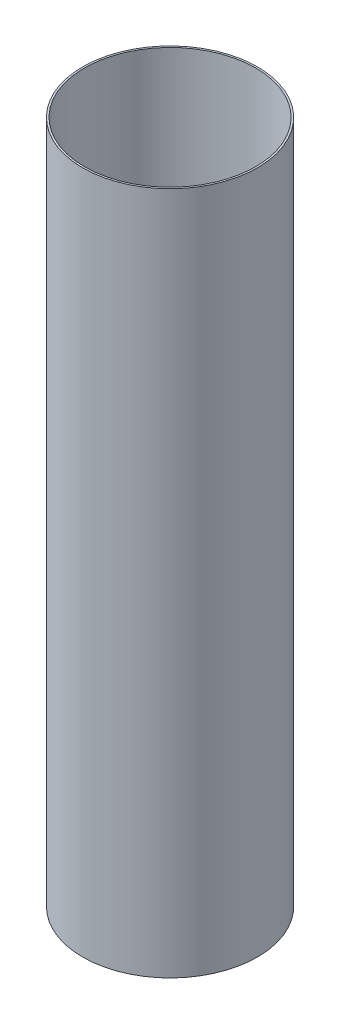
ISO-10303-21;
HEADER;
FILE_DESCRIPTION(('STEP AP214'),'2;1');
FILE_NAME('part.step','',(''),(''),'','','');
FILE_SCHEMA(('AUTOMOTIVE_DESIGN { 1 0 10303 214 1 1 1 1 }'));
ENDSEC;
DATA;
#1=APPLICATION_CONTEXT('core data for automotive mechanical design processes');
#2=APPLICATION_PROTOCOL_DEFINITION('international standard','automotive_design',2000,#1);
#3=PRODUCT_CONTEXT('',#1,'mechanical');
#4=PRODUCT('Part','Part','',(#3));
#5=PRODUCT_RELATED_PRODUCT_CATEGORY('part','',(#4));
#6=PRODUCT_DEFINITION_FORMATION('','',#4);
#7=PRODUCT_DEFINITION_CONTEXT('part definition',#1,'design');
#8=PRODUCT_DEFINITION('design','',#6,#7);
#9=PRODUCT_DEFINITION_SHAPE('','',#8);
#10=(LENGTH_UNIT() NAMED_UNIT(*) SI_UNIT(.MILLI.,.METRE.));
#11=(NAMED_UNIT(*) PLANE_ANGLE_UNIT() SI_UNIT($,.RADIAN.));
#12=(NAMED_UNIT(*) SI_UNIT($,.STERADIAN.) SOLID_ANGLE_UNIT());
#13=UNCERTAINTY_MEASURE_WITH_UNIT(LENGTH_MEASURE(1.E-05),#10,'distance_accuracy_value','');
#14=(GEOMETRIC_REPRESENTATION_CONTEXT(3) GLOBAL_UNCERTAINTY_ASSIGNED_CONTEXT((#13)) GLOBAL_UNIT_ASSIGNED_CONTEXT((#10,
#11,#12)) REPRESENTATION_CONTEXT('',''));
#15=CARTESIAN_POINT('',(0.,0.,0.));
#16=DIRECTION('',(0.,0.,1.));
#17=DIRECTION('',(1.,0.,0.));
#18=AXIS2_PLACEMENT_3D('',#15,#16,#17);
#19=CARTESIAN_POINT('',(0.,762.,0.));
#20=DIRECTION('',(0.,1.,0.));
#21=DIRECTION('',(0.,0.,1.));
#22=AXIS2_PLACEMENT_3D('',#19,#20,#21);
#23=PLANE('',#22);
#24=CARTESIAN_POINT('',(0.,762.,0.));
#25=DIRECTION('',(0.,1.,0.));
#26=DIRECTION('',(0.,0.,1.));
#27=AXIS2_PLACEMENT_3D('',#24,#25,#26);
#28=CIRCLE('',#27,97.4725);
#29=CARTESIAN_POINT('',(0.,762.,97.4725));
#30=VERTEX_POINT('',#29);
#31=EDGE_CURVE('E10',#30,#30,#28,.T.);
#32=ORIENTED_EDGE('',*,*,#31,.T.);
#33=EDGE_LOOP('',(#32));
#34=FACE_BOUND('',#33,.T.);
#35=CARTESIAN_POINT('',(0.,762.,0.));
#36=DIRECTION('',(0.,1.,0.));
#37=DIRECTION('',(0.,0.,1.));
#38=AXIS2_PLACEMENT_3D('',#35,#36,#37);
#39=CIRCLE('',#38,95.4405);
#40=CARTESIAN_POINT('',(0.,762.,95.4405));
#41=VERTEX_POINT('',#40);
#42=EDGE_CURVE('E41',#41,#41,#39,.T.);
#43=ORIENTED_EDGE('',*,*,#42,.F.);
#44=EDGE_LOOP('',(#43));
#45=FACE_BOUND('',#44,.T.);
#46=ADVANCED_FACE('F30',(#34,#45),#23,.T.);
#47=CARTESIAN_POINT('',(0.,0.,0.));
#48=DIRECTION('',(0.,1.,0.));
#49=DIRECTION('',(0.,0.,1.));
#50=AXIS2_PLACEMENT_3D('',#47,#48,#49);
#51=PLANE('',#50);
#52=CARTESIAN_POINT('',(0.,0.,0.));
#53=DIRECTION('',(0.,1.,0.));
#54=DIRECTION('',(0.,0.,1.));
#55=AXIS2_PLACEMENT_3D('',#52,#53,#54);
#56=CIRCLE('',#55,97.4725);
#57=CARTESIAN_POINT('',(0.,0.,97.4725));
#58=VERTEX_POINT('',#57);
#59=EDGE_CURVE('E34',#58,#58,#56,.T.);
#60=ORIENTED_EDGE('',*,*,#59,.F.);
#61=EDGE_LOOP('',(#60));
#62=FACE_BOUND('',#61,.T.);
#63=CARTESIAN_POINT('',(0.,0.,0.));
#64=DIRECTION('',(0.,1.,0.));
#65=DIRECTION('',(0.,0.,1.));
#66=AXIS2_PLACEMENT_3D('',#63,#64,#65);
#67=CIRCLE('',#66,95.4405);
#68=CARTESIAN_POINT('',(0.,0.,95.4405));
#69=VERTEX_POINT('',#68);
#70=EDGE_CURVE('E43',#69,#69,#67,.T.);
#71=ORIENTED_EDGE('',*,*,#70,.T.);
#72=EDGE_LOOP('',(#71));
#73=FACE_BOUND('',#72,.T.);
#74=ADVANCED_FACE('F53',(#62,#73),#51,.F.);
#75=CARTESIAN_POINT('',(0.,762.,0.));
#76=DIRECTION('',(0.,-1.,0.));
#77=DIRECTION('',(0.,0.,-1.));
#78=AXIS2_PLACEMENT_3D('',#75,#76,#77);
#79=CYLINDRICAL_SURFACE('',#78,97.4725);
#80=ORIENTED_EDGE('',*,*,#31,.F.);
#81=EDGE_LOOP('',(#80));
#82=FACE_BOUND('',#81,.T.);
#83=ORIENTED_EDGE('',*,*,#59,.T.);
#84=EDGE_LOOP('',(#83));
#85=FACE_BOUND('',#84,.T.);
#86=ADVANCED_FACE('F32',(#82,#85),#79,.T.);
#87=CARTESIAN_POINT('',(0.,762.,0.));
#88=DIRECTION('',(0.,-1.,0.));
#89=DIRECTION('',(0.,0.,-1.));
#90=AXIS2_PLACEMENT_3D('',#87,#88,#89);
#91=CYLINDRICAL_SURFACE('',#90,95.4405);
#92=ORIENTED_EDGE('',*,*,#42,.T.);
#93=EDGE_LOOP('',(#92));
#94=FACE_BOUND('',#93,.T.);
#95=ORIENTED_EDGE('',*,*,#70,.F.);
#96=EDGE_LOOP('',(#95));
#97=FACE_BOUND('',#96,.T.);
#98=ADVANCED_FACE('F49',(#94,#97),#91,.F.);
#99=CLOSED_SHELL('',(#46,#74,#86,#98));
#100=MANIFOLD_SOLID_BREP('B2',#99);
#101=ADVANCED_BREP_SHAPE_REPRESENTATION('',(#18,#100),#14);
#102=SHAPE_DEFINITION_REPRESENTATION(#9,#101);
ENDSEC;
END-ISO-10303-21;
